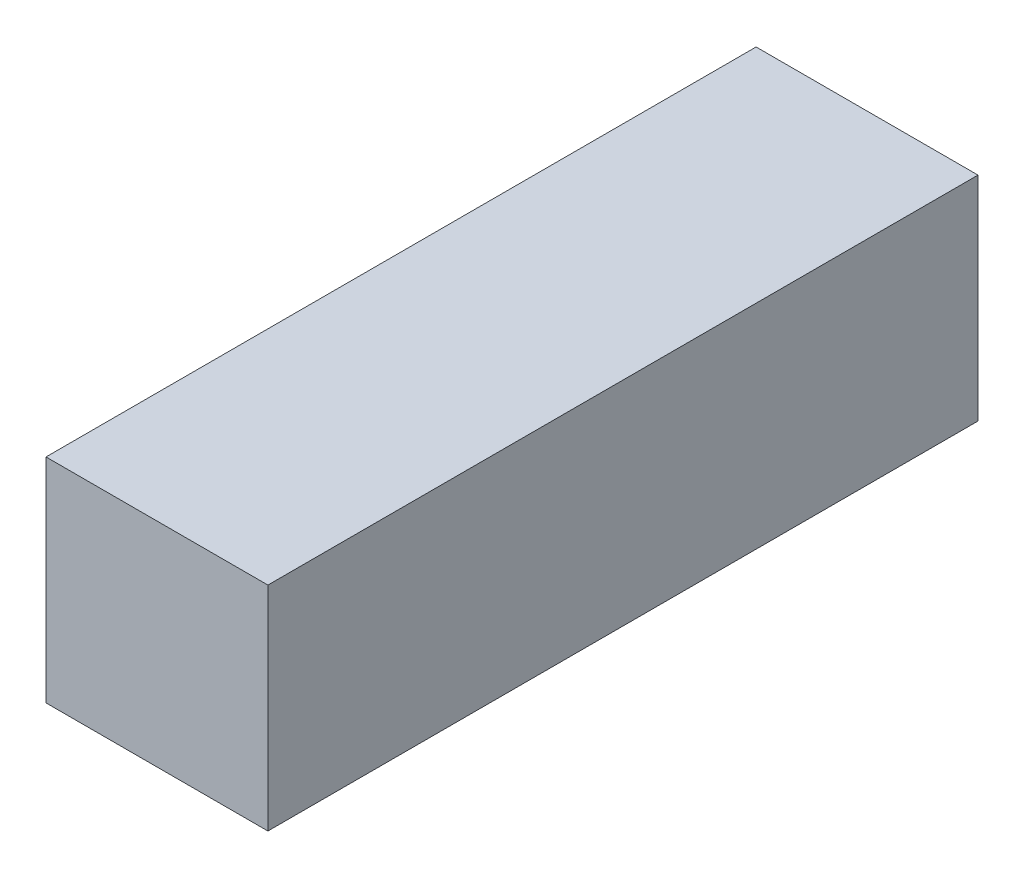
ISO-10303-21;
HEADER;
FILE_DESCRIPTION(('STEP AP214'),'2;1');
FILE_NAME('part.step','',(''),(''),'','','');
FILE_SCHEMA(('AUTOMOTIVE_DESIGN { 1 0 10303 214 1 1 1 1 }'));
ENDSEC;
DATA;
#1=APPLICATION_CONTEXT('core data for automotive mechanical design processes');
#2=APPLICATION_PROTOCOL_DEFINITION('international standard','automotive_design',2000,#1);
#3=PRODUCT_CONTEXT('',#1,'mechanical');
#4=PRODUCT('Part','Part','',(#3));
#5=PRODUCT_RELATED_PRODUCT_CATEGORY('part','',(#4));
#6=PRODUCT_DEFINITION_FORMATION('','',#4);
#7=PRODUCT_DEFINITION_CONTEXT('part definition',#1,'design');
#8=PRODUCT_DEFINITION('design','',#6,#7);
#9=PRODUCT_DEFINITION_SHAPE('','',#8);
#10=(LENGTH_UNIT() NAMED_UNIT(*) SI_UNIT(.MILLI.,.METRE.));
#11=(NAMED_UNIT(*) PLANE_ANGLE_UNIT() SI_UNIT($,.RADIAN.));
#12=(NAMED_UNIT(*) SI_UNIT($,.STERADIAN.) SOLID_ANGLE_UNIT());
#13=UNCERTAINTY_MEASURE_WITH_UNIT(LENGTH_MEASURE(1.E-05),#10,'distance_accuracy_value','');
#14=(GEOMETRIC_REPRESENTATION_CONTEXT(3) GLOBAL_UNCERTAINTY_ASSIGNED_CONTEXT((#13)) GLOBAL_UNIT_ASSIGNED_CONTEXT((#10,
#11,#12)) REPRESENTATION_CONTEXT('',''));
#15=CARTESIAN_POINT('',(0.,0.,0.));
#16=DIRECTION('',(0.,0.,1.));
#17=DIRECTION('',(1.,0.,0.));
#18=AXIS2_PLACEMENT_3D('',#15,#16,#17);
#19=CARTESIAN_POINT('',(-404.161717831615,2527.79898694596,2657.20686703076));
#20=DIRECTION('',(1.,0.,0.));
#21=DIRECTION('',(0.,0.,-1.));
#22=AXIS2_PLACEMENT_3D('',#19,#20,#21);
#23=PLANE('',#22);
#24=DIRECTION('',(0.,0.,-1.));
#25=VECTOR('',#24,1.);
#26=CARTESIAN_POINT('',(-404.161717831615,2575.79898694596,2657.20686703076));
#27=LINE('',#26,#25);
#28=CARTESIAN_POINT('',(-404.161717831615,2575.79898694596,2817.20686703076));
#29=VERTEX_POINT('',#28);
#30=CARTESIAN_POINT('',(-404.161717831615,2575.79898694596,2657.20686703076));
#31=VERTEX_POINT('',#30);
#32=EDGE_CURVE('E95',#29,#31,#27,.T.);
#33=ORIENTED_EDGE('',*,*,#32,.T.);
#34=DIRECTION('',(0.,1.,0.));
#35=VECTOR('',#34,1.);
#36=CARTESIAN_POINT('',(-404.161717831615,2527.79898694596,2657.20686703076));
#37=LINE('',#36,#35);
#38=CARTESIAN_POINT('',(-404.161717831615,2527.79898694596,2657.20686703076));
#39=VERTEX_POINT('',#38);
#40=EDGE_CURVE('E11',#39,#31,#37,.T.);
#41=ORIENTED_EDGE('',*,*,#40,.F.);
#42=DIRECTION('',(0.,0.,-1.));
#43=VECTOR('',#42,1.);
#44=CARTESIAN_POINT('',(-404.161717831615,2527.79898694596,2657.20686703076));
#45=LINE('',#44,#43);
#46=CARTESIAN_POINT('',(-404.161717831615,2527.79898694596,2817.20686703076));
#47=VERTEX_POINT('',#46);
#48=EDGE_CURVE('E83',#47,#39,#45,.T.);
#49=ORIENTED_EDGE('',*,*,#48,.F.);
#50=DIRECTION('',(0.,1.,0.));
#51=VECTOR('',#50,1.);
#52=CARTESIAN_POINT('',(-404.161717831615,2527.79898694596,2817.20686703076));
#53=LINE('',#52,#51);
#54=EDGE_CURVE('E91',#47,#29,#53,.T.);
#55=ORIENTED_EDGE('',*,*,#54,.T.);
#56=EDGE_LOOP('',(#33,#41,#49,#55));
#57=FACE_BOUND('',#56,.T.);
#58=ADVANCED_FACE('F32',(#57),#23,.F.);
#59=CARTESIAN_POINT('',(-354.161717831615,2527.79898694596,2657.20686703076));
#60=DIRECTION('',(0.,0.,1.));
#61=DIRECTION('',(0.,-1.,0.));
#62=AXIS2_PLACEMENT_3D('',#59,#60,#61);
#63=PLANE('',#62);
#64=DIRECTION('',(1.,0.,0.));
#65=VECTOR('',#64,1.);
#66=CARTESIAN_POINT('',(-354.161717831615,2575.79898694596,2657.20686703076));
#67=LINE('',#66,#65);
#68=CARTESIAN_POINT('',(-354.161717831615,2575.79898694596,2657.20686703076));
#69=VERTEX_POINT('',#68);
#70=EDGE_CURVE('E87',#31,#69,#67,.T.);
#71=ORIENTED_EDGE('',*,*,#70,.T.);
#72=DIRECTION('',(0.,1.,0.));
#73=VECTOR('',#72,1.);
#74=CARTESIAN_POINT('',(-354.161717831615,2527.79898694596,2657.20686703076));
#75=LINE('',#74,#73);
#76=CARTESIAN_POINT('',(-354.161717831615,2527.79898694596,2657.20686703076));
#77=VERTEX_POINT('',#76);
#78=EDGE_CURVE('E40',#77,#69,#75,.T.);
#79=ORIENTED_EDGE('',*,*,#78,.F.);
#80=DIRECTION('',(1.,0.,0.));
#81=VECTOR('',#80,1.);
#82=CARTESIAN_POINT('',(-354.161717831615,2527.79898694596,2657.20686703076));
#83=LINE('',#82,#81);
#84=EDGE_CURVE('E78',#39,#77,#83,.T.);
#85=ORIENTED_EDGE('',*,*,#84,.F.);
#86=ORIENTED_EDGE('',*,*,#40,.T.);
#87=EDGE_LOOP('',(#71,#79,#85,#86));
#88=FACE_BOUND('',#87,.T.);
#89=ADVANCED_FACE('F86',(#88),#63,.F.);
#90=CARTESIAN_POINT('',(-354.161717831615,2527.79898694596,2657.20686703076));
#91=DIRECTION('',(-1.,0.,0.));
#92=DIRECTION('',(0.,0.,1.));
#93=AXIS2_PLACEMENT_3D('',#90,#91,#92);
#94=PLANE('',#93);
#95=DIRECTION('',(0.,0.,1.));
#96=VECTOR('',#95,1.);
#97=CARTESIAN_POINT('',(-354.161717831615,2575.79898694596,2657.20686703076));
#98=LINE('',#97,#96);
#99=CARTESIAN_POINT('',(-354.161717831615,2575.79898694596,2817.20686703076));
#100=VERTEX_POINT('',#99);
#101=EDGE_CURVE('E65',#69,#100,#98,.T.);
#102=ORIENTED_EDGE('',*,*,#101,.T.);
#103=DIRECTION('',(0.,1.,0.));
#104=VECTOR('',#103,1.);
#105=CARTESIAN_POINT('',(-354.161717831615,2527.79898694596,2817.20686703076));
#106=LINE('',#105,#104);
#107=CARTESIAN_POINT('',(-354.161717831615,2527.79898694596,2817.20686703076));
#108=VERTEX_POINT('',#107);
#109=EDGE_CURVE('E88',#108,#100,#106,.T.);
#110=ORIENTED_EDGE('',*,*,#109,.F.);
#111=DIRECTION('',(0.,0.,1.));
#112=VECTOR('',#111,1.);
#113=CARTESIAN_POINT('',(-354.161717831615,2527.79898694596,2657.20686703076));
#114=LINE('',#113,#112);
#115=EDGE_CURVE('E81',#77,#108,#114,.T.);
#116=ORIENTED_EDGE('',*,*,#115,.F.);
#117=ORIENTED_EDGE('',*,*,#78,.T.);
#118=EDGE_LOOP('',(#102,#110,#116,#117));
#119=FACE_BOUND('',#118,.T.);
#120=ADVANCED_FACE('F89',(#119),#94,.F.);
#121=CARTESIAN_POINT('',(-354.161717831615,2527.79898694596,2817.20686703076));
#122=DIRECTION('',(0.,0.,-1.));
#123=DIRECTION('',(0.,1.,0.));
#124=AXIS2_PLACEMENT_3D('',#121,#122,#123);
#125=PLANE('',#124);
#126=DIRECTION('',(-1.,0.,0.));
#127=VECTOR('',#126,1.);
#128=CARTESIAN_POINT('',(-354.161717831615,2575.79898694596,2817.20686703076));
#129=LINE('',#128,#127);
#130=EDGE_CURVE('E71',#100,#29,#129,.T.);
#131=ORIENTED_EDGE('',*,*,#130,.T.);
#132=ORIENTED_EDGE('',*,*,#54,.F.);
#133=DIRECTION('',(-1.,0.,0.));
#134=VECTOR('',#133,1.);
#135=CARTESIAN_POINT('',(-354.161717831615,2527.79898694596,2817.20686703076));
#136=LINE('',#135,#134);
#137=EDGE_CURVE('E48',#108,#47,#136,.T.);
#138=ORIENTED_EDGE('',*,*,#137,.F.);
#139=ORIENTED_EDGE('',*,*,#109,.T.);
#140=EDGE_LOOP('',(#131,#132,#138,#139));
#141=FACE_BOUND('',#140,.T.);
#142=ADVANCED_FACE('F102',(#141),#125,.F.);
#143=CARTESIAN_POINT('',(0.,2527.79898694596,0.));
#144=DIRECTION('',(0.,-1.,0.));
#145=DIRECTION('',(0.,0.,-1.));
#146=AXIS2_PLACEMENT_3D('',#143,#144,#145);
#147=PLANE('',#146);
#148=ORIENTED_EDGE('',*,*,#48,.T.);
#149=ORIENTED_EDGE('',*,*,#84,.T.);
#150=ORIENTED_EDGE('',*,*,#115,.T.);
#151=ORIENTED_EDGE('',*,*,#137,.T.);
#152=EDGE_LOOP('',(#148,#149,#150,#151));
#153=FACE_BOUND('',#152,.T.);
#154=ADVANCED_FACE('F79',(#153),#147,.T.);
#155=CARTESIAN_POINT('',(0.,2575.79898694596,0.));
#156=DIRECTION('',(0.,-1.,0.));
#157=DIRECTION('',(0.,0.,-1.));
#158=AXIS2_PLACEMENT_3D('',#155,#156,#157);
#159=PLANE('',#158);
#160=ORIENTED_EDGE('',*,*,#32,.F.);
#161=ORIENTED_EDGE('',*,*,#130,.F.);
#162=ORIENTED_EDGE('',*,*,#101,.F.);
#163=ORIENTED_EDGE('',*,*,#70,.F.);
#164=EDGE_LOOP('',(#160,#161,#162,#163));
#165=FACE_BOUND('',#164,.T.);
#166=ADVANCED_FACE('F105',(#165),#159,.F.);
#167=CLOSED_SHELL('',(#58,#89,#120,#142,#154,#166));
#168=MANIFOLD_SOLID_BREP('B2',#167);
#169=ADVANCED_BREP_SHAPE_REPRESENTATION('',(#18,#168),#14);
#170=SHAPE_DEFINITION_REPRESENTATION(#9,#169);
ENDSEC;
END-ISO-10303-21;
